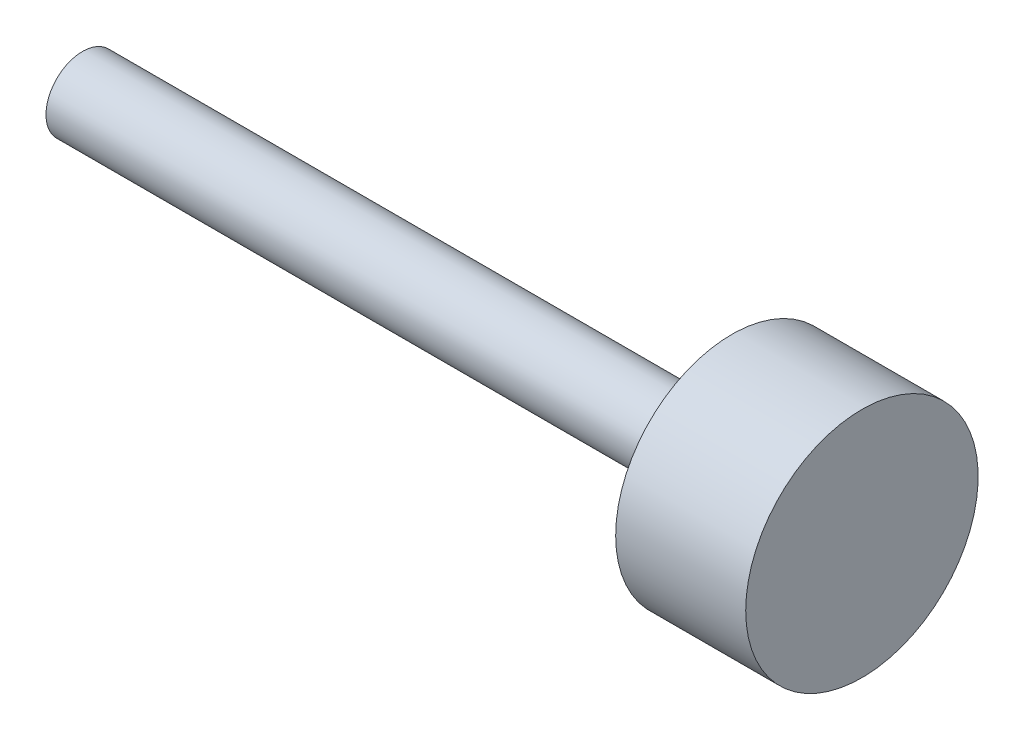
ISO-10303-21;
HEADER;
FILE_DESCRIPTION(('STEP AP214'),'2;1');
FILE_NAME('part.step','',(''),(''),'','','');
FILE_SCHEMA(('AUTOMOTIVE_DESIGN { 1 0 10303 214 1 1 1 1 }'));
ENDSEC;
DATA;
#1=APPLICATION_CONTEXT('core data for automotive mechanical design processes');
#2=APPLICATION_PROTOCOL_DEFINITION('international standard','automotive_design',2000,#1);
#3=PRODUCT_CONTEXT('',#1,'mechanical');
#4=PRODUCT('Part','Part','',(#3));
#5=PRODUCT_RELATED_PRODUCT_CATEGORY('part','',(#4));
#6=PRODUCT_DEFINITION_FORMATION('','',#4);
#7=PRODUCT_DEFINITION_CONTEXT('part definition',#1,'design');
#8=PRODUCT_DEFINITION('design','',#6,#7);
#9=PRODUCT_DEFINITION_SHAPE('','',#8);
#10=(LENGTH_UNIT() NAMED_UNIT(*) SI_UNIT(.MILLI.,.METRE.));
#11=(NAMED_UNIT(*) PLANE_ANGLE_UNIT() SI_UNIT($,.RADIAN.));
#12=(NAMED_UNIT(*) SI_UNIT($,.STERADIAN.) SOLID_ANGLE_UNIT());
#13=UNCERTAINTY_MEASURE_WITH_UNIT(LENGTH_MEASURE(1.E-05),#10,'distance_accuracy_value','');
#14=(GEOMETRIC_REPRESENTATION_CONTEXT(3) GLOBAL_UNCERTAINTY_ASSIGNED_CONTEXT((#13)) GLOBAL_UNIT_ASSIGNED_CONTEXT((#10,
#11,#12)) REPRESENTATION_CONTEXT('',''));
#15=CARTESIAN_POINT('',(0.,0.,0.));
#16=DIRECTION('',(0.,0.,1.));
#17=DIRECTION('',(1.,0.,0.));
#18=AXIS2_PLACEMENT_3D('',#15,#16,#17);
#19=CARTESIAN_POINT('',(-22.225,0.,0.));
#20=DIRECTION('',(1.,0.,0.));
#21=DIRECTION('',(0.,0.,-1.));
#22=AXIS2_PLACEMENT_3D('',#19,#20,#21);
#23=PLANE('',#22);
#24=CARTESIAN_POINT('',(-22.225,0.,0.));
#25=DIRECTION('',(-1.,0.,0.));
#26=DIRECTION('',(0.,0.,1.));
#27=AXIS2_PLACEMENT_3D('',#24,#25,#26);
#28=CIRCLE('',#27,5.55625);
#29=CARTESIAN_POINT('',(-22.225,0.,5.55625));
#30=VERTEX_POINT('',#29);
#31=EDGE_CURVE('E63',#30,#30,#28,.T.);
#32=ORIENTED_EDGE('',*,*,#31,.F.);
#33=EDGE_LOOP('',(#32));
#34=FACE_BOUND('',#33,.T.);
#35=CARTESIAN_POINT('',(-22.225,0.,0.));
#36=DIRECTION('',(-1.,0.,0.));
#37=DIRECTION('',(0.,0.,1.));
#38=AXIS2_PLACEMENT_3D('',#35,#36,#37);
#39=CIRCLE('',#38,8.001);
#40=CARTESIAN_POINT('',(-22.225,0.,8.001));
#41=VERTEX_POINT('',#40);
#42=EDGE_CURVE('E11',#41,#41,#39,.T.);
#43=ORIENTED_EDGE('',*,*,#42,.T.);
#44=EDGE_LOOP('',(#43));
#45=FACE_BOUND('',#44,.T.);
#46=ADVANCED_FACE('F37',(#34,#45),#23,.F.);
#47=CARTESIAN_POINT('',(148.4376,0.,0.));
#48=DIRECTION('',(-1.,0.,0.));
#49=DIRECTION('',(0.,0.,1.));
#50=AXIS2_PLACEMENT_3D('',#47,#48,#49);
#51=CYLINDRICAL_SURFACE('',#50,8.001);
#52=ORIENTED_EDGE('',*,*,#42,.F.);
#53=EDGE_LOOP('',(#52));
#54=FACE_BOUND('',#53,.T.);
#55=CARTESIAN_POINT('',(119.9642,0.,0.));
#56=DIRECTION('',(-1.,0.,0.));
#57=DIRECTION('',(0.,0.,1.));
#58=AXIS2_PLACEMENT_3D('',#55,#56,#57);
#59=CIRCLE('',#58,8.001);
#60=CARTESIAN_POINT('',(119.9642,0.,8.001));
#61=VERTEX_POINT('',#60);
#62=EDGE_CURVE('E43',#61,#61,#59,.T.);
#63=ORIENTED_EDGE('',*,*,#62,.T.);
#64=EDGE_LOOP('',(#63));
#65=FACE_BOUND('',#64,.T.);
#66=ADVANCED_FACE('F71',(#54,#65),#51,.T.);
#67=CARTESIAN_POINT('',(119.9642,8.001,0.));
#68=DIRECTION('',(1.,0.,0.));
#69=DIRECTION('',(0.,0.,-1.));
#70=AXIS2_PLACEMENT_3D('',#67,#68,#69);
#71=PLANE('',#70);
#72=ORIENTED_EDGE('',*,*,#62,.F.);
#73=EDGE_LOOP('',(#72));
#74=FACE_BOUND('',#73,.T.);
#75=CARTESIAN_POINT('',(119.9642,0.,0.));
#76=DIRECTION('',(-1.,0.,0.));
#77=DIRECTION('',(0.,0.,1.));
#78=AXIS2_PLACEMENT_3D('',#75,#76,#77);
#79=CIRCLE('',#78,25.4508);
#80=CARTESIAN_POINT('',(119.9642,0.,25.4508));
#81=VERTEX_POINT('',#80);
#82=EDGE_CURVE('E60',#81,#81,#79,.T.);
#83=ORIENTED_EDGE('',*,*,#82,.T.);
#84=EDGE_LOOP('',(#83));
#85=FACE_BOUND('',#84,.T.);
#86=ADVANCED_FACE('F73',(#74,#85),#71,.F.);
#87=CARTESIAN_POINT('',(148.4376,0.,0.));
#88=DIRECTION('',(-1.,0.,0.));
#89=DIRECTION('',(0.,0.,1.));
#90=AXIS2_PLACEMENT_3D('',#87,#88,#89);
#91=CYLINDRICAL_SURFACE('',#90,25.4508);
#92=ORIENTED_EDGE('',*,*,#82,.F.);
#93=EDGE_LOOP('',(#92));
#94=FACE_BOUND('',#93,.T.);
#95=CARTESIAN_POINT('',(148.4376,0.,0.));
#96=DIRECTION('',(-1.,0.,0.));
#97=DIRECTION('',(0.,0.,1.));
#98=AXIS2_PLACEMENT_3D('',#95,#96,#97);
#99=CIRCLE('',#98,25.4508);
#100=CARTESIAN_POINT('',(148.4376,0.,25.4508));
#101=VERTEX_POINT('',#100);
#102=EDGE_CURVE('E56',#101,#101,#99,.T.);
#103=ORIENTED_EDGE('',*,*,#102,.T.);
#104=EDGE_LOOP('',(#103));
#105=FACE_BOUND('',#104,.T.);
#106=ADVANCED_FACE('F76',(#94,#105),#91,.T.);
#107=CARTESIAN_POINT('',(148.4376,25.4508,0.));
#108=DIRECTION('',(-1.,0.,0.));
#109=DIRECTION('',(0.,0.,1.));
#110=AXIS2_PLACEMENT_3D('',#107,#108,#109);
#111=PLANE('',#110);
#112=ORIENTED_EDGE('',*,*,#102,.F.);
#113=EDGE_LOOP('',(#112));
#114=FACE_BOUND('',#113,.T.);
#115=ADVANCED_FACE('F50',(#114),#111,.F.);
#116=CARTESIAN_POINT('',(5.83747761626726,0.,0.));
#117=DIRECTION('',(-1.,0.,0.));
#118=DIRECTION('',(0.,0.,1.));
#119=AXIS2_PLACEMENT_3D('',#116,#117,#118);
#120=CONICAL_SURFACE('',#119,4.86918,1.0471975511966);
#121=CARTESIAN_POINT('',(8.64870000000002,0.,0.));
#122=VERTEX_POINT('',#121);
#123=VERTEX_LOOP('',#122);
#124=FACE_BOUND('',#123,.T.);
#125=CARTESIAN_POINT('',(5.83747761626726,0.,0.));
#126=DIRECTION('',(-1.,0.,0.));
#127=DIRECTION('',(0.,0.,1.));
#128=AXIS2_PLACEMENT_3D('',#125,#126,#127);
#129=CIRCLE('',#128,4.86918);
#130=CARTESIAN_POINT('',(5.83747761626726,0.,4.86918));
#131=VERTEX_POINT('',#130);
#132=EDGE_CURVE('E54',#131,#131,#129,.T.);
#133=ORIENTED_EDGE('',*,*,#132,.T.);
#134=EDGE_LOOP('',(#133));
#135=FACE_BOUND('',#134,.T.);
#136=ADVANCED_FACE('F46',(#124,#135),#120,.F.);
#137=CARTESIAN_POINT('',(-22.225,0.,0.));
#138=DIRECTION('',(-1.,0.,0.));
#139=DIRECTION('',(0.,0.,1.));
#140=AXIS2_PLACEMENT_3D('',#137,#138,#139);
#141=CYLINDRICAL_SURFACE('',#140,4.86918);
#142=ORIENTED_EDGE('',*,*,#132,.F.);
#143=EDGE_LOOP('',(#142));
#144=FACE_BOUND('',#143,.T.);
#145=CARTESIAN_POINT('',(-21.53793,0.,0.));
#146=DIRECTION('',(-1.,0.,0.));
#147=DIRECTION('',(0.,0.,1.));
#148=AXIS2_PLACEMENT_3D('',#145,#146,#147);
#149=CIRCLE('',#148,4.86918);
#150=CARTESIAN_POINT('',(-21.53793,0.,4.86918));
#151=VERTEX_POINT('',#150);
#152=EDGE_CURVE('E57',#151,#151,#149,.T.);
#153=ORIENTED_EDGE('',*,*,#152,.T.);
#154=EDGE_LOOP('',(#153));
#155=FACE_BOUND('',#154,.T.);
#156=ADVANCED_FACE('F49',(#144,#155),#141,.F.);
#157=CARTESIAN_POINT('',(-22.225,0.,0.));
#158=DIRECTION('',(-1.,0.,0.));
#159=DIRECTION('',(0.,0.,1.));
#160=AXIS2_PLACEMENT_3D('',#157,#158,#159);
#161=CONICAL_SURFACE('',#160,5.55625,0.785398163397446);
#162=ORIENTED_EDGE('',*,*,#152,.F.);
#163=EDGE_LOOP('',(#162));
#164=FACE_BOUND('',#163,.T.);
#165=ORIENTED_EDGE('',*,*,#31,.T.);
#166=EDGE_LOOP('',(#165));
#167=FACE_BOUND('',#166,.T.);
#168=ADVANCED_FACE('F100',(#164,#167),#161,.F.);
#169=CLOSED_SHELL('',(#46,#66,#86,#106,#115,#136,#156,#168));
#170=MANIFOLD_SOLID_BREP('B2',#169);
#171=ADVANCED_BREP_SHAPE_REPRESENTATION('',(#18,#170),#14);
#172=SHAPE_DEFINITION_REPRESENTATION(#9,#171);
ENDSEC;
END-ISO-10303-21;
